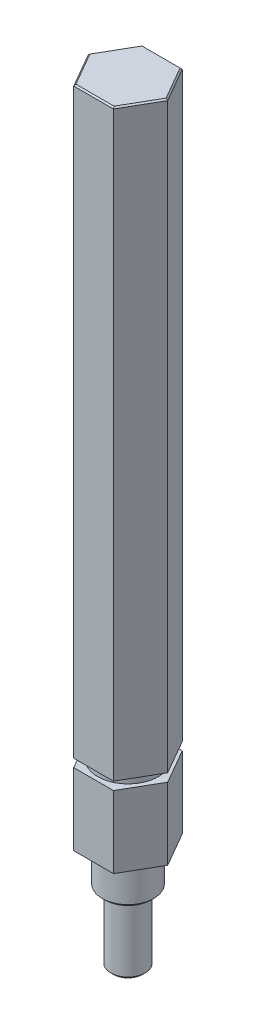
ISO-10303-21;
HEADER;
FILE_DESCRIPTION(('STEP AP214'),'2;1');
FILE_NAME('part.step','',(''),(''),'','','');
FILE_SCHEMA(('AUTOMOTIVE_DESIGN { 1 0 10303 214 1 1 1 1 }'));
ENDSEC;
DATA;
#1=APPLICATION_CONTEXT('core data for automotive mechanical design processes');
#2=APPLICATION_PROTOCOL_DEFINITION('international standard','automotive_design',2000,#1);
#3=PRODUCT_CONTEXT('',#1,'mechanical');
#4=PRODUCT('Part','Part','',(#3));
#5=PRODUCT_RELATED_PRODUCT_CATEGORY('part','',(#4));
#6=PRODUCT_DEFINITION_FORMATION('','',#4);
#7=PRODUCT_DEFINITION_CONTEXT('part definition',#1,'design');
#8=PRODUCT_DEFINITION('design','',#6,#7);
#9=PRODUCT_DEFINITION_SHAPE('','',#8);
#10=(LENGTH_UNIT() NAMED_UNIT(*) SI_UNIT(.MILLI.,.METRE.));
#11=(NAMED_UNIT(*) PLANE_ANGLE_UNIT() SI_UNIT($,.RADIAN.));
#12=(NAMED_UNIT(*) SI_UNIT($,.STERADIAN.) SOLID_ANGLE_UNIT());
#13=UNCERTAINTY_MEASURE_WITH_UNIT(LENGTH_MEASURE(1.E-05),#10,'distance_accuracy_value','');
#14=(GEOMETRIC_REPRESENTATION_CONTEXT(3) GLOBAL_UNCERTAINTY_ASSIGNED_CONTEXT((#13)) GLOBAL_UNIT_ASSIGNED_CONTEXT((#10,
#11,#12)) REPRESENTATION_CONTEXT('',''));
#15=CARTESIAN_POINT('',(0.,0.,0.));
#16=DIRECTION('',(0.,0.,1.));
#17=DIRECTION('',(1.,0.,0.));
#18=AXIS2_PLACEMENT_3D('',#15,#16,#17);
#19=CARTESIAN_POINT('',(-45.6394821348514,-25.4,-16.669011646302));
#20=DIRECTION('',(-0.866025403784438,0.,0.5));
#21=DIRECTION('',(0.5,0.,0.866025403784439));
#22=AXIS2_PLACEMENT_3D('',#19,#20,#21);
#23=PLANE('',#22);
#24=DIRECTION('',(0.5,0.,0.866025403784439));
#25=VECTOR('',#24,1.);
#26=CARTESIAN_POINT('',(-45.6394821348514,-12.1158,-16.669011646302));
#27=LINE('',#26,#25);
#28=CARTESIAN_POINT('',(-45.6394821348514,-12.1158,-16.669011646302));
#29=VERTEX_POINT('',#28);
#30=CARTESIAN_POINT('',(-41.9733079254973,-12.1158,-10.319011646302));
#31=VERTEX_POINT('',#30);
#32=EDGE_CURVE('E264',#29,#31,#27,.T.);
#33=ORIENTED_EDGE('',*,*,#32,.F.);
#34=DIRECTION('',(0.,1.,0.));
#35=VECTOR('',#34,1.);
#36=CARTESIAN_POINT('',(-45.6394821348514,-25.4,-16.669011646302));
#37=LINE('',#36,#35);
#38=CARTESIAN_POINT('',(-45.6394821348514,-25.4,-16.669011646302));
#39=VERTEX_POINT('',#38);
#40=EDGE_CURVE('E300',#39,#29,#37,.T.);
#41=ORIENTED_EDGE('',*,*,#40,.F.);
#42=DIRECTION('',(0.5,0.,0.866025403784439));
#43=VECTOR('',#42,1.);
#44=CARTESIAN_POINT('',(-45.6394821348514,-25.4,-16.669011646302));
#45=LINE('',#44,#43);
#46=CARTESIAN_POINT('',(-41.9733079254973,-25.4,-10.319011646302));
#47=VERTEX_POINT('',#46);
#48=EDGE_CURVE('E284',#39,#47,#45,.T.);
#49=ORIENTED_EDGE('',*,*,#48,.T.);
#50=DIRECTION('',(0.,1.,0.));
#51=VECTOR('',#50,1.);
#52=CARTESIAN_POINT('',(-41.9733079254973,-25.4,-10.319011646302));
#53=LINE('',#52,#51);
#54=EDGE_CURVE('E193',#47,#31,#53,.T.);
#55=ORIENTED_EDGE('',*,*,#54,.T.);
#56=EDGE_LOOP('',(#33,#41,#49,#55));
#57=FACE_BOUND('',#56,.T.);
#58=ADVANCED_FACE('F50',(#57),#23,.T.);
#59=CARTESIAN_POINT('',(-41.9733079254973,-25.4,-10.319011646302));
#60=DIRECTION('',(0.,0.,1.));
#61=DIRECTION('',(1.,0.,0.));
#62=AXIS2_PLACEMENT_3D('',#59,#60,#61);
#63=PLANE('',#62);
#64=DIRECTION('',(1.,0.,0.));
#65=VECTOR('',#64,1.);
#66=CARTESIAN_POINT('',(-41.9733079254973,-12.1158,-10.319011646302));
#67=LINE('',#66,#65);
#68=CARTESIAN_POINT('',(-34.640959506789,-12.1158,-10.319011646302));
#69=VERTEX_POINT('',#68);
#70=EDGE_CURVE('E165',#31,#69,#67,.T.);
#71=ORIENTED_EDGE('',*,*,#70,.F.);
#72=ORIENTED_EDGE('',*,*,#54,.F.);
#73=DIRECTION('',(1.,0.,0.));
#74=VECTOR('',#73,1.);
#75=CARTESIAN_POINT('',(-41.9733079254973,-25.4,-10.319011646302));
#76=LINE('',#75,#74);
#77=CARTESIAN_POINT('',(-34.640959506789,-25.4,-10.319011646302));
#78=VERTEX_POINT('',#77);
#79=EDGE_CURVE('E285',#47,#78,#76,.T.);
#80=ORIENTED_EDGE('',*,*,#79,.T.);
#81=DIRECTION('',(0.,1.,0.));
#82=VECTOR('',#81,1.);
#83=CARTESIAN_POINT('',(-34.640959506789,-25.4,-10.319011646302));
#84=LINE('',#83,#82);
#85=EDGE_CURVE('E187',#78,#69,#84,.T.);
#86=ORIENTED_EDGE('',*,*,#85,.T.);
#87=EDGE_LOOP('',(#71,#72,#80,#86));
#88=FACE_BOUND('',#87,.T.);
#89=ADVANCED_FACE('F358',(#88),#63,.T.);
#90=CARTESIAN_POINT('',(-34.640959506789,-25.4,-10.319011646302));
#91=DIRECTION('',(0.866025403784438,0.,0.500000000000001));
#92=DIRECTION('',(0.500000000000001,0.,-0.866025403784438));
#93=AXIS2_PLACEMENT_3D('',#90,#91,#92);
#94=PLANE('',#93);
#95=DIRECTION('',(0.500000000000001,0.,-0.866025403784438));
#96=VECTOR('',#95,1.);
#97=CARTESIAN_POINT('',(-34.640959506789,-12.1158,-10.319011646302));
#98=LINE('',#97,#96);
#99=CARTESIAN_POINT('',(-30.9747852974349,-12.1158,-16.669011646302));
#100=VERTEX_POINT('',#99);
#101=EDGE_CURVE('E159',#69,#100,#98,.T.);
#102=ORIENTED_EDGE('',*,*,#101,.F.);
#103=ORIENTED_EDGE('',*,*,#85,.F.);
#104=DIRECTION('',(0.500000000000001,0.,-0.866025403784438));
#105=VECTOR('',#104,1.);
#106=CARTESIAN_POINT('',(-34.640959506789,-25.4,-10.319011646302));
#107=LINE('',#106,#105);
#108=CARTESIAN_POINT('',(-30.9747852974349,-25.4,-16.669011646302));
#109=VERTEX_POINT('',#108);
#110=EDGE_CURVE('E181',#78,#109,#107,.T.);
#111=ORIENTED_EDGE('',*,*,#110,.T.);
#112=DIRECTION('',(0.,1.,0.));
#113=VECTOR('',#112,1.);
#114=CARTESIAN_POINT('',(-30.9747852974349,-25.4,-16.669011646302));
#115=LINE('',#114,#113);
#116=EDGE_CURVE('E174',#109,#100,#115,.T.);
#117=ORIENTED_EDGE('',*,*,#116,.T.);
#118=EDGE_LOOP('',(#102,#103,#111,#117));
#119=FACE_BOUND('',#118,.T.);
#120=ADVANCED_FACE('F179',(#119),#94,.T.);
#121=CARTESIAN_POINT('',(-30.9747852974349,-25.4,-16.669011646302));
#122=DIRECTION('',(0.866025403784438,0.,-0.5));
#123=DIRECTION('',(-0.5,0.,-0.866025403784439));
#124=AXIS2_PLACEMENT_3D('',#121,#122,#123);
#125=PLANE('',#124);
#126=DIRECTION('',(-0.5,0.,-0.866025403784439));
#127=VECTOR('',#126,1.);
#128=CARTESIAN_POINT('',(-30.9747852974349,-12.1158,-16.669011646302));
#129=LINE('',#128,#127);
#130=CARTESIAN_POINT('',(-34.640959506789,-12.1158,-23.019011646302));
#131=VERTEX_POINT('',#130);
#132=EDGE_CURVE('E162',#100,#131,#129,.T.);
#133=ORIENTED_EDGE('',*,*,#132,.F.);
#134=ORIENTED_EDGE('',*,*,#116,.F.);
#135=DIRECTION('',(-0.5,0.,-0.866025403784439));
#136=VECTOR('',#135,1.);
#137=CARTESIAN_POINT('',(-30.9747852974349,-25.4,-16.669011646302));
#138=LINE('',#137,#136);
#139=CARTESIAN_POINT('',(-34.640959506789,-25.4,-23.019011646302));
#140=VERTEX_POINT('',#139);
#141=EDGE_CURVE('E289',#109,#140,#138,.T.);
#142=ORIENTED_EDGE('',*,*,#141,.T.);
#143=DIRECTION('',(0.,1.,0.));
#144=VECTOR('',#143,1.);
#145=CARTESIAN_POINT('',(-34.640959506789,-25.4,-23.019011646302));
#146=LINE('',#145,#144);
#147=EDGE_CURVE('E176',#140,#131,#146,.T.);
#148=ORIENTED_EDGE('',*,*,#147,.T.);
#149=EDGE_LOOP('',(#133,#134,#142,#148));
#150=FACE_BOUND('',#149,.T.);
#151=ADVANCED_FACE('F172',(#150),#125,.T.);
#152=CARTESIAN_POINT('',(-34.640959506789,-25.4,-23.019011646302));
#153=DIRECTION('',(0.,0.,-1.));
#154=DIRECTION('',(-1.,0.,0.));
#155=AXIS2_PLACEMENT_3D('',#152,#153,#154);
#156=PLANE('',#155);
#157=DIRECTION('',(-1.,0.,0.));
#158=VECTOR('',#157,1.);
#159=CARTESIAN_POINT('',(-34.640959506789,-12.1158,-23.019011646302));
#160=LINE('',#159,#158);
#161=CARTESIAN_POINT('',(-41.9733079254973,-12.1158,-23.019011646302));
#162=VERTEX_POINT('',#161);
#163=EDGE_CURVE('E177',#131,#162,#160,.T.);
#164=ORIENTED_EDGE('',*,*,#163,.F.);
#165=ORIENTED_EDGE('',*,*,#147,.F.);
#166=DIRECTION('',(-1.,0.,0.));
#167=VECTOR('',#166,1.);
#168=CARTESIAN_POINT('',(-34.640959506789,-25.4,-23.019011646302));
#169=LINE('',#168,#167);
#170=CARTESIAN_POINT('',(-41.9733079254973,-25.4,-23.019011646302));
#171=VERTEX_POINT('',#170);
#172=EDGE_CURVE('E291',#140,#171,#169,.T.);
#173=ORIENTED_EDGE('',*,*,#172,.T.);
#174=DIRECTION('',(0.,1.,0.));
#175=VECTOR('',#174,1.);
#176=CARTESIAN_POINT('',(-41.9733079254973,-25.4,-23.019011646302));
#177=LINE('',#176,#175);
#178=EDGE_CURVE('E303',#171,#162,#177,.T.);
#179=ORIENTED_EDGE('',*,*,#178,.T.);
#180=EDGE_LOOP('',(#164,#165,#173,#179));
#181=FACE_BOUND('',#180,.T.);
#182=ADVANCED_FACE('F463',(#181),#156,.T.);
#183=CARTESIAN_POINT('',(-41.9733079254973,-25.4,-23.019011646302));
#184=DIRECTION('',(-0.866025403784438,0.,-0.5));
#185=DIRECTION('',(-0.5,0.,0.866025403784439));
#186=AXIS2_PLACEMENT_3D('',#183,#184,#185);
#187=PLANE('',#186);
#188=DIRECTION('',(-0.5,0.,0.866025403784439));
#189=VECTOR('',#188,1.);
#190=CARTESIAN_POINT('',(-41.9733079254973,-12.1158,-23.019011646302));
#191=LINE('',#190,#189);
#192=EDGE_CURVE('E208',#162,#29,#191,.T.);
#193=ORIENTED_EDGE('',*,*,#192,.F.);
#194=ORIENTED_EDGE('',*,*,#178,.F.);
#195=DIRECTION('',(-0.5,0.,0.866025403784439));
#196=VECTOR('',#195,1.);
#197=CARTESIAN_POINT('',(-41.9733079254973,-25.4,-23.019011646302));
#198=LINE('',#197,#196);
#199=EDGE_CURVE('E294',#171,#39,#198,.T.);
#200=ORIENTED_EDGE('',*,*,#199,.T.);
#201=ORIENTED_EDGE('',*,*,#40,.T.);
#202=EDGE_LOOP('',(#193,#194,#200,#201));
#203=FACE_BOUND('',#202,.T.);
#204=ADVANCED_FACE('F473',(#203),#187,.T.);
#205=CARTESIAN_POINT('',(-38.3071337161431,-25.4,-3.96901164630201));
#206=DIRECTION('',(0.,1.,0.));
#207=DIRECTION('',(0.,0.,1.));
#208=AXIS2_PLACEMENT_3D('',#205,#206,#207);
#209=PLANE('',#208);
#210=CARTESIAN_POINT('',(-38.3071337161431,-25.4,-16.669011646302));
#211=DIRECTION('',(0.,1.,0.));
#212=DIRECTION('',(1.,0.,0.));
#213=AXIS2_PLACEMENT_3D('',#210,#211,#212);
#214=CIRCLE('',#213,4.7498);
#215=CARTESIAN_POINT('',(-33.5573337161431,-25.4,-16.669011646302));
#216=VERTEX_POINT('',#215);
#217=EDGE_CURVE('E280',#216,#216,#214,.T.);
#218=ORIENTED_EDGE('',*,*,#217,.T.);
#219=EDGE_LOOP('',(#218));
#220=FACE_BOUND('',#219,.T.);
#221=ORIENTED_EDGE('',*,*,#48,.F.);
#222=ORIENTED_EDGE('',*,*,#199,.F.);
#223=ORIENTED_EDGE('',*,*,#172,.F.);
#224=ORIENTED_EDGE('',*,*,#141,.F.);
#225=ORIENTED_EDGE('',*,*,#110,.F.);
#226=ORIENTED_EDGE('',*,*,#79,.F.);
#227=EDGE_LOOP('',(#221,#222,#223,#224,#225,#226));
#228=FACE_BOUND('',#227,.T.);
#229=ADVANCED_FACE('F579',(#220,#228),#209,.F.);
#230=CARTESIAN_POINT('',(-38.3071337161431,-32.512,-16.669011646302));
#231=DIRECTION('',(0.,1.,0.));
#232=DIRECTION('',(0.,0.,1.));
#233=AXIS2_PLACEMENT_3D('',#230,#231,#232);
#234=CYLINDRICAL_SURFACE('',#233,4.7498);
#235=CARTESIAN_POINT('',(-38.3071337161431,-32.004,-16.669011646302));
#236=DIRECTION('',(0.,1.,0.));
#237=DIRECTION('',(0.,0.,1.));
#238=AXIS2_PLACEMENT_3D('',#235,#236,#237);
#239=CIRCLE('',#238,4.7498);
#240=CARTESIAN_POINT('',(-38.3071337161431,-32.004,-11.919211646302));
#241=VERTEX_POINT('',#240);
#242=EDGE_CURVE('E196',#241,#241,#239,.T.);
#243=ORIENTED_EDGE('',*,*,#242,.T.);
#244=EDGE_LOOP('',(#243));
#245=FACE_BOUND('',#244,.T.);
#246=ORIENTED_EDGE('',*,*,#217,.F.);
#247=EDGE_LOOP('',(#246));
#248=FACE_BOUND('',#247,.T.);
#249=ADVANCED_FACE('F568',(#245,#248),#234,.T.);
#250=CARTESIAN_POINT('',(-38.3071337161431,-32.512,-16.669011646302));
#251=DIRECTION('',(0.,1.,0.));
#252=DIRECTION('',(0.,0.,1.));
#253=AXIS2_PLACEMENT_3D('',#250,#251,#252);
#254=PLANE('',#253);
#255=CARTESIAN_POINT('',(-38.3071337161431,-32.512,-16.669011646302));
#256=DIRECTION('',(0.,1.,0.));
#257=DIRECTION('',(0.,0.,1.));
#258=AXIS2_PLACEMENT_3D('',#255,#256,#257);
#259=CIRCLE('',#258,3.1623);
#260=CARTESIAN_POINT('',(-38.3071337161431,-32.512,-13.506711646302));
#261=VERTEX_POINT('',#260);
#262=EDGE_CURVE('E276',#261,#261,#259,.T.);
#263=ORIENTED_EDGE('',*,*,#262,.T.);
#264=EDGE_LOOP('',(#263));
#265=FACE_BOUND('',#264,.T.);
#266=CARTESIAN_POINT('',(-38.3071337161431,-32.512,-16.669011646302));
#267=DIRECTION('',(0.,1.,0.));
#268=DIRECTION('',(0.,0.,1.));
#269=AXIS2_PLACEMENT_3D('',#266,#267,#268);
#270=CIRCLE('',#269,4.2418);
#271=CARTESIAN_POINT('',(-38.3071337161431,-32.512,-12.427211646302));
#272=VERTEX_POINT('',#271);
#273=EDGE_CURVE('E199',#272,#272,#270,.F.);
#274=ORIENTED_EDGE('',*,*,#273,.T.);
#275=EDGE_LOOP('',(#274));
#276=FACE_BOUND('',#275,.T.);
#277=ADVANCED_FACE('F556',(#265,#276),#254,.F.);
#278=CARTESIAN_POINT('',(-38.3071337161431,-32.004,-16.669011646302));
#279=DIRECTION('',(0.,1.,0.));
#280=DIRECTION('',(0.,0.,1.));
#281=AXIS2_PLACEMENT_3D('',#278,#279,#280);
#282=CONICAL_SURFACE('',#281,4.7498,0.785398163397443);
#283=ORIENTED_EDGE('',*,*,#273,.F.);
#284=EDGE_LOOP('',(#283));
#285=FACE_BOUND('',#284,.T.);
#286=ORIENTED_EDGE('',*,*,#242,.F.);
#287=EDGE_LOOP('',(#286));
#288=FACE_BOUND('',#287,.T.);
#289=ADVANCED_FACE('F543',(#285,#288),#282,.T.);
#290=CARTESIAN_POINT('',(-38.3071337161431,-45.212,-16.669011646302));
#291=DIRECTION('',(0.,1.,0.));
#292=DIRECTION('',(0.,0.,1.));
#293=AXIS2_PLACEMENT_3D('',#290,#291,#292);
#294=CYLINDRICAL_SURFACE('',#293,3.1623);
#295=CARTESIAN_POINT('',(-38.3071337161431,-44.704,-16.669011646302));
#296=DIRECTION('',(0.,1.,0.));
#297=DIRECTION('',(0.,0.,1.));
#298=AXIS2_PLACEMENT_3D('',#295,#296,#297);
#299=CIRCLE('',#298,3.1623);
#300=CARTESIAN_POINT('',(-38.3071337161431,-44.704,-13.506711646302));
#301=VERTEX_POINT('',#300);
#302=EDGE_CURVE('E202',#301,#301,#299,.T.);
#303=ORIENTED_EDGE('',*,*,#302,.T.);
#304=EDGE_LOOP('',(#303));
#305=FACE_BOUND('',#304,.T.);
#306=ORIENTED_EDGE('',*,*,#262,.F.);
#307=EDGE_LOOP('',(#306));
#308=FACE_BOUND('',#307,.T.);
#309=ADVANCED_FACE('F531',(#305,#308),#294,.T.);
#310=CARTESIAN_POINT('',(-38.3071337161431,-45.212,-16.669011646302));
#311=DIRECTION('',(0.,1.,0.));
#312=DIRECTION('',(0.,0.,1.));
#313=AXIS2_PLACEMENT_3D('',#310,#311,#312);
#314=PLANE('',#313);
#315=CARTESIAN_POINT('',(-38.3071337161431,-45.212,-16.669011646302));
#316=DIRECTION('',(0.,1.,0.));
#317=DIRECTION('',(0.,0.,1.));
#318=AXIS2_PLACEMENT_3D('',#315,#316,#317);
#319=CIRCLE('',#318,2.6543);
#320=CARTESIAN_POINT('',(-38.3071337161431,-45.212,-14.014711646302));
#321=VERTEX_POINT('',#320);
#322=EDGE_CURVE('E205',#321,#321,#319,.F.);
#323=ORIENTED_EDGE('',*,*,#322,.T.);
#324=EDGE_LOOP('',(#323));
#325=FACE_BOUND('',#324,.T.);
#326=ADVANCED_FACE('F485',(#325),#314,.F.);
#327=CARTESIAN_POINT('',(-38.3071337161431,-44.704,-16.669011646302));
#328=DIRECTION('',(0.,1.,0.));
#329=DIRECTION('',(0.,0.,1.));
#330=AXIS2_PLACEMENT_3D('',#327,#328,#329);
#331=CONICAL_SURFACE('',#330,3.1623,0.785398163397445);
#332=ORIENTED_EDGE('',*,*,#322,.F.);
#333=EDGE_LOOP('',(#332));
#334=FACE_BOUND('',#333,.T.);
#335=ORIENTED_EDGE('',*,*,#302,.F.);
#336=EDGE_LOOP('',(#335));
#337=FACE_BOUND('',#336,.T.);
#338=ADVANCED_FACE('F479',(#334,#337),#331,.T.);
#339=CARTESIAN_POINT('',(-38.3071337161431,-25.4,-16.669011646302));
#340=DIRECTION('',(0.,1.,0.));
#341=DIRECTION('',(0.,0.,1.));
#342=AXIS2_PLACEMENT_3D('',#339,#340,#341);
#343=CYLINDRICAL_SURFACE('',#342,5.58800000000003);
#344=CARTESIAN_POINT('',(-38.3071337161431,-10.6172,-16.669011646302));
#345=DIRECTION('',(0.,1.,0.));
#346=DIRECTION('',(0.,0.,1.));
#347=AXIS2_PLACEMENT_3D('',#344,#345,#346);
#348=CIRCLE('',#347,5.58800000000003);
#349=CARTESIAN_POINT('',(-38.3071337161431,-10.6172,-11.081011646302));
#350=VERTEX_POINT('',#349);
#351=EDGE_CURVE('E255',#350,#350,#348,.T.);
#352=ORIENTED_EDGE('',*,*,#351,.F.);
#353=EDGE_LOOP('',(#352));
#354=FACE_BOUND('',#353,.T.);
#355=CARTESIAN_POINT('',(-38.3071337161431,-12.1158,-16.669011646302));
#356=DIRECTION('',(0.,1.,0.));
#357=DIRECTION('',(0.,0.,1.));
#358=AXIS2_PLACEMENT_3D('',#355,#356,#357);
#359=CIRCLE('',#358,5.58800000000003);
#360=CARTESIAN_POINT('',(-38.3071337161431,-12.1158,-11.081011646302));
#361=VERTEX_POINT('',#360);
#362=EDGE_CURVE('E249',#361,#361,#359,.T.);
#363=ORIENTED_EDGE('',*,*,#362,.T.);
#364=EDGE_LOOP('',(#363));
#365=FACE_BOUND('',#364,.T.);
#366=ADVANCED_FACE('F484',(#354,#365),#343,.T.);
#367=CARTESIAN_POINT('',(-32.7191337161431,-10.6172,-16.669011646302));
#368=DIRECTION('',(0.,1.,0.));
#369=DIRECTION('',(0.,0.,1.));
#370=AXIS2_PLACEMENT_3D('',#367,#368,#369);
#371=PLANE('',#370);
#372=DIRECTION('',(0.5,0.,0.866025403784439));
#373=VECTOR('',#372,1.);
#374=CARTESIAN_POINT('',(-30.9747852974349,-10.6172,-16.669011646302));
#375=LINE('',#374,#373);
#376=CARTESIAN_POINT('',(-34.640959506789,-10.6172,-23.019011646302));
#377=VERTEX_POINT('',#376);
#378=CARTESIAN_POINT('',(-30.9747852974349,-10.6172,-16.669011646302));
#379=VERTEX_POINT('',#378);
#380=EDGE_CURVE('E268',#377,#379,#375,.T.);
#381=ORIENTED_EDGE('',*,*,#380,.T.);
#382=DIRECTION('',(-0.500000000000001,0.,0.866025403784438));
#383=VECTOR('',#382,1.);
#384=CARTESIAN_POINT('',(-34.640959506789,-10.6172,-10.319011646302));
#385=LINE('',#384,#383);
#386=CARTESIAN_POINT('',(-34.640959506789,-10.6172,-10.319011646302));
#387=VERTEX_POINT('',#386);
#388=EDGE_CURVE('E270',#379,#387,#385,.T.);
#389=ORIENTED_EDGE('',*,*,#388,.T.);
#390=DIRECTION('',(-1.,0.,0.));
#391=VECTOR('',#390,1.);
#392=CARTESIAN_POINT('',(-41.9733079254973,-10.6172,-10.319011646302));
#393=LINE('',#392,#391);
#394=CARTESIAN_POINT('',(-41.9733079254973,-10.6172,-10.319011646302));
#395=VERTEX_POINT('',#394);
#396=EDGE_CURVE('E272',#387,#395,#393,.T.);
#397=ORIENTED_EDGE('',*,*,#396,.T.);
#398=DIRECTION('',(-0.5,0.,-0.866025403784439));
#399=VECTOR('',#398,1.);
#400=CARTESIAN_POINT('',(-45.6394821348514,-10.6172,-16.669011646302));
#401=LINE('',#400,#399);
#402=CARTESIAN_POINT('',(-45.6394821348514,-10.6172,-16.669011646302));
#403=VERTEX_POINT('',#402);
#404=EDGE_CURVE('E274',#395,#403,#401,.T.);
#405=ORIENTED_EDGE('',*,*,#404,.T.);
#406=DIRECTION('',(0.5,0.,-0.866025403784439));
#407=VECTOR('',#406,1.);
#408=CARTESIAN_POINT('',(-41.9733079254973,-10.6172,-23.019011646302));
#409=LINE('',#408,#407);
#410=CARTESIAN_POINT('',(-41.9733079254973,-10.6172,-23.019011646302));
#411=VERTEX_POINT('',#410);
#412=EDGE_CURVE('E210',#403,#411,#409,.T.);
#413=ORIENTED_EDGE('',*,*,#412,.T.);
#414=DIRECTION('',(1.,0.,0.));
#415=VECTOR('',#414,1.);
#416=CARTESIAN_POINT('',(-34.640959506789,-10.6172,-23.019011646302));
#417=LINE('',#416,#415);
#418=EDGE_CURVE('E266',#411,#377,#417,.T.);
#419=ORIENTED_EDGE('',*,*,#418,.T.);
#420=EDGE_LOOP('',(#381,#389,#397,#405,#413,#419));
#421=FACE_BOUND('',#420,.T.);
#422=ORIENTED_EDGE('',*,*,#351,.T.);
#423=EDGE_LOOP('',(#422));
#424=FACE_BOUND('',#423,.T.);
#425=ADVANCED_FACE('F499',(#421,#424),#371,.F.);
#426=CARTESIAN_POINT('',(-21.7881364409388,-12.1158,-16.669011646302));
#427=DIRECTION('',(0.,-1.,0.));
#428=DIRECTION('',(0.,0.,-1.));
#429=AXIS2_PLACEMENT_3D('',#426,#427,#428);
#430=PLANE('',#429);
#431=ORIENTED_EDGE('',*,*,#362,.F.);
#432=EDGE_LOOP('',(#431));
#433=FACE_BOUND('',#432,.T.);
#434=ORIENTED_EDGE('',*,*,#32,.T.);
#435=ORIENTED_EDGE('',*,*,#70,.T.);
#436=ORIENTED_EDGE('',*,*,#101,.T.);
#437=ORIENTED_EDGE('',*,*,#132,.T.);
#438=ORIENTED_EDGE('',*,*,#163,.T.);
#439=ORIENTED_EDGE('',*,*,#192,.T.);
#440=EDGE_LOOP('',(#434,#435,#436,#437,#438,#439));
#441=FACE_BOUND('',#440,.T.);
#442=ADVANCED_FACE('F161',(#433,#441),#430,.F.);
#443=CARTESIAN_POINT('',(-45.6394821348514,96.8273400000005,-16.669011646302));
#444=VERTEX_POINT('',#443);
#445=EDGE_CURVE('E297',#403,#444,#37,.T.);
#446=ORIENTED_EDGE('',*,*,#445,.T.);
#447=DIRECTION('',(0.5,0.,-0.866025403784439));
#448=VECTOR('',#447,1.);
#449=CARTESIAN_POINT('',(-41.9733079254972,96.8273400000005,-23.0190116463021));
#450=LINE('',#449,#448);
#451=CARTESIAN_POINT('',(-41.9733079254973,96.8273400000005,-23.019011646302));
#452=VERTEX_POINT('',#451);
#453=EDGE_CURVE('E230',#444,#452,#450,.T.);
#454=ORIENTED_EDGE('',*,*,#453,.T.);
#455=EDGE_CURVE('E302',#411,#452,#177,.T.);
#456=ORIENTED_EDGE('',*,*,#455,.F.);
#457=ORIENTED_EDGE('',*,*,#412,.F.);
#458=EDGE_LOOP('',(#446,#454,#456,#457));
#459=FACE_BOUND('',#458,.T.);
#460=ADVANCED_FACE('F345',(#459),#187,.T.);
#461=ORIENTED_EDGE('',*,*,#455,.T.);
#462=DIRECTION('',(1.,0.,0.));
#463=VECTOR('',#462,1.);
#464=CARTESIAN_POINT('',(-34.6409595067889,96.8273400000005,-23.019011646302));
#465=LINE('',#464,#463);
#466=CARTESIAN_POINT('',(-34.640959506789,96.8273400000005,-23.019011646302));
#467=VERTEX_POINT('',#466);
#468=EDGE_CURVE('E74',#452,#467,#465,.T.);
#469=ORIENTED_EDGE('',*,*,#468,.T.);
#470=EDGE_CURVE('E305',#377,#467,#146,.T.);
#471=ORIENTED_EDGE('',*,*,#470,.F.);
#472=ORIENTED_EDGE('',*,*,#418,.F.);
#473=EDGE_LOOP('',(#461,#469,#471,#472));
#474=FACE_BOUND('',#473,.T.);
#475=ADVANCED_FACE('F309',(#474),#156,.T.);
#476=ORIENTED_EDGE('',*,*,#470,.T.);
#477=DIRECTION('',(0.5,0.,0.866025403784439));
#478=VECTOR('',#477,1.);
#479=CARTESIAN_POINT('',(-30.9747852974349,96.8273400000005,-16.669011646302));
#480=LINE('',#479,#478);
#481=CARTESIAN_POINT('',(-30.9747852974349,96.8273400000005,-16.669011646302));
#482=VERTEX_POINT('',#481);
#483=EDGE_CURVE('E59',#467,#482,#480,.T.);
#484=ORIENTED_EDGE('',*,*,#483,.T.);
#485=EDGE_CURVE('E184',#379,#482,#115,.T.);
#486=ORIENTED_EDGE('',*,*,#485,.F.);
#487=ORIENTED_EDGE('',*,*,#380,.F.);
#488=EDGE_LOOP('',(#476,#484,#486,#487));
#489=FACE_BOUND('',#488,.T.);
#490=ADVANCED_FACE('F444',(#489),#125,.T.);
#491=ORIENTED_EDGE('',*,*,#485,.T.);
#492=DIRECTION('',(-0.500000000000001,0.,0.866025403784438));
#493=VECTOR('',#492,1.);
#494=CARTESIAN_POINT('',(-34.640959506789,96.8273400000005,-10.3190116463021));
#495=LINE('',#494,#493);
#496=CARTESIAN_POINT('',(-34.640959506789,96.8273400000005,-10.319011646302));
#497=VERTEX_POINT('',#496);
#498=EDGE_CURVE('E11',#482,#497,#495,.T.);
#499=ORIENTED_EDGE('',*,*,#498,.T.);
#500=EDGE_CURVE('E183',#387,#497,#84,.T.);
#501=ORIENTED_EDGE('',*,*,#500,.F.);
#502=ORIENTED_EDGE('',*,*,#388,.F.);
#503=EDGE_LOOP('',(#491,#499,#501,#502));
#504=FACE_BOUND('',#503,.T.);
#505=ADVANCED_FACE('F323',(#504),#94,.T.);
#506=ORIENTED_EDGE('',*,*,#500,.T.);
#507=DIRECTION('',(-1.,0.,0.));
#508=VECTOR('',#507,1.);
#509=CARTESIAN_POINT('',(-41.9733079254972,96.8273400000005,-10.319011646302));
#510=LINE('',#509,#508);
#511=CARTESIAN_POINT('',(-41.9733079254973,96.8273400000005,-10.319011646302));
#512=VERTEX_POINT('',#511);
#513=EDGE_CURVE('E225',#497,#512,#510,.T.);
#514=ORIENTED_EDGE('',*,*,#513,.T.);
#515=EDGE_CURVE('E192',#395,#512,#53,.T.);
#516=ORIENTED_EDGE('',*,*,#515,.F.);
#517=ORIENTED_EDGE('',*,*,#396,.F.);
#518=EDGE_LOOP('',(#506,#514,#516,#517));
#519=FACE_BOUND('',#518,.T.);
#520=ADVANCED_FACE('F328',(#519),#63,.T.);
#521=ORIENTED_EDGE('',*,*,#515,.T.);
#522=DIRECTION('',(-0.5,0.,-0.866025403784439));
#523=VECTOR('',#522,1.);
#524=CARTESIAN_POINT('',(-45.6394821348514,96.8273400000005,-16.669011646302));
#525=LINE('',#524,#523);
#526=EDGE_CURVE('E228',#512,#444,#525,.T.);
#527=ORIENTED_EDGE('',*,*,#526,.T.);
#528=ORIENTED_EDGE('',*,*,#445,.F.);
#529=ORIENTED_EDGE('',*,*,#404,.F.);
#530=EDGE_LOOP('',(#521,#527,#528,#529));
#531=FACE_BOUND('',#530,.T.);
#532=ADVANCED_FACE('F343',(#531),#23,.T.);
#533=CARTESIAN_POINT('',(-38.3071337161451,97.0813400000005,-16.6690116463026));
#534=DIRECTION('',(0.,1.,0.));
#535=DIRECTION('',(-0.500000000000001,0.,0.866025403784438));
#536=AXIS2_PLACEMENT_3D('',#533,#534,#535);
#537=PLANE('',#536);
#538=DIRECTION('',(0.5,0.,0.866025403784439));
#539=VECTOR('',#538,1.);
#540=CARTESIAN_POINT('',(-43.5864245776138,97.0813400000005,-13.6210116463033));
#541=LINE('',#540,#539);
#542=CARTESIAN_POINT('',(-45.3461881981031,97.0813400000005,-16.669011646302));
#543=VERTEX_POINT('',#542);
#544=CARTESIAN_POINT('',(-41.8266609571231,97.0813400000005,-10.573011646302));
#545=VERTEX_POINT('',#544);
#546=EDGE_CURVE('E220',#543,#545,#541,.T.);
#547=ORIENTED_EDGE('',*,*,#546,.T.);
#548=DIRECTION('',(1.,0.,0.));
#549=VECTOR('',#548,1.);
#550=CARTESIAN_POINT('',(-38.3071337161451,97.0813400000005,-10.573011646302));
#551=LINE('',#550,#549);
#552=CARTESIAN_POINT('',(-34.7876064751632,97.0813400000005,-10.573011646302));
#553=VERTEX_POINT('',#552);
#554=EDGE_CURVE('E222',#545,#553,#551,.T.);
#555=ORIENTED_EDGE('',*,*,#554,.T.);
#556=DIRECTION('',(0.500000000000001,0.,-0.866025403784438));
#557=VECTOR('',#556,1.);
#558=CARTESIAN_POINT('',(-33.0278428546734,97.0813400000005,-13.6210116463016));
#559=LINE('',#558,#557);
#560=CARTESIAN_POINT('',(-31.2680792341832,97.0813400000005,-16.669011646302));
#561=VERTEX_POINT('',#560);
#562=EDGE_CURVE('E212',#553,#561,#559,.T.);
#563=ORIENTED_EDGE('',*,*,#562,.T.);
#564=DIRECTION('',(-0.5,0.,-0.866025403784439));
#565=VECTOR('',#564,1.);
#566=CARTESIAN_POINT('',(-33.0278428546739,97.0813400000005,-19.7170116463033));
#567=LINE('',#566,#565);
#568=CARTESIAN_POINT('',(-34.7876064751632,97.0813400000005,-22.765011646302));
#569=VERTEX_POINT('',#568);
#570=EDGE_CURVE('E214',#561,#569,#567,.T.);
#571=ORIENTED_EDGE('',*,*,#570,.T.);
#572=DIRECTION('',(-1.,0.,0.));
#573=VECTOR('',#572,1.);
#574=CARTESIAN_POINT('',(-38.3071337161451,97.0813400000005,-22.765011646302));
#575=LINE('',#574,#573);
#576=CARTESIAN_POINT('',(-41.8266609571231,97.0813400000005,-22.765011646302));
#577=VERTEX_POINT('',#576);
#578=EDGE_CURVE('E216',#569,#577,#575,.T.);
#579=ORIENTED_EDGE('',*,*,#578,.T.);
#580=DIRECTION('',(-0.5,0.,0.866025403784439));
#581=VECTOR('',#580,1.);
#582=CARTESIAN_POINT('',(-43.5864245776133,97.0813400000005,-19.7170116463016));
#583=LINE('',#582,#581);
#584=EDGE_CURVE('E218',#577,#543,#583,.T.);
#585=ORIENTED_EDGE('',*,*,#584,.T.);
#586=EDGE_LOOP('',(#547,#555,#563,#571,#579,#585));
#587=FACE_BOUND('',#586,.T.);
#588=ADVANCED_FACE('F348',(#587),#537,.T.);
#589=CARTESIAN_POINT('',(-38.3071337161451,97.0813400000005,-22.765011646302));
#590=DIRECTION('',(0.,-0.707106781186551,0.707106781186544));
#591=DIRECTION('',(0.,-0.707106781186544,-0.707106781186551));
#592=AXIS2_PLACEMENT_3D('',#589,#590,#591);
#593=PLANE('',#592);
#594=DIRECTION('',(-0.377964473009204,0.654653670707981,0.654653670707987));
#595=VECTOR('',#594,1.);
#596=CARTESIAN_POINT('',(-35.2903960810172,97.9521971428573,-21.8941545034452));
#597=LINE('',#596,#595);
#598=EDGE_CURVE('E243',#467,#569,#597,.T.);
#599=ORIENTED_EDGE('',*,*,#598,.F.);
#600=ORIENTED_EDGE('',*,*,#468,.F.);
#601=DIRECTION('',(0.377964473009226,0.654653670707974,0.654653670707981));
#602=VECTOR('',#601,1.);
#603=CARTESIAN_POINT('',(-41.3238713512691,97.9521971428571,-21.8941545034453));
#604=LINE('',#603,#602);
#605=EDGE_CURVE('E54',#577,#452,#604,.F.);
#606=ORIENTED_EDGE('',*,*,#605,.F.);
#607=ORIENTED_EDGE('',*,*,#578,.F.);
#608=EDGE_LOOP('',(#599,#600,#606,#607));
#609=FACE_BOUND('',#608,.T.);
#610=ADVANCED_FACE('F52',(#609),#593,.F.);
#611=CARTESIAN_POINT('',(-43.5864245776133,97.0813400000005,-19.7170116463016));
#612=DIRECTION('',(0.612372435695792,-0.70710678118655,0.353553390593274));
#613=DIRECTION('',(0.755928946018457,0.654653670707975,0.));
#614=AXIS2_PLACEMENT_3D('',#611,#612,#613);
#615=PLANE('',#614);
#616=ORIENTED_EDGE('',*,*,#605,.T.);
#617=ORIENTED_EDGE('',*,*,#453,.F.);
#618=DIRECTION('',(0.75592894601846,0.654653670707971,0.));
#619=VECTOR('',#618,1.);
#620=CARTESIAN_POINT('',(-44.3406089863946,97.9521971428575,-16.669011646302));
#621=LINE('',#620,#619);
#622=EDGE_CURVE('E241',#543,#444,#621,.F.);
#623=ORIENTED_EDGE('',*,*,#622,.F.);
#624=ORIENTED_EDGE('',*,*,#584,.F.);
#625=EDGE_LOOP('',(#616,#617,#623,#624));
#626=FACE_BOUND('',#625,.T.);
#627=ADVANCED_FACE('F346',(#626),#615,.F.);
#628=CARTESIAN_POINT('',(-33.0278428546739,97.0813400000005,-19.7170116463033));
#629=DIRECTION('',(-0.612372435695803,-0.707106781186538,0.353553390593279));
#630=DIRECTION('',(0.755928946018445,-0.654653670707988,0.));
#631=AXIS2_PLACEMENT_3D('',#628,#629,#630);
#632=PLANE('',#631);
#633=ORIENTED_EDGE('',*,*,#598,.T.);
#634=ORIENTED_EDGE('',*,*,#570,.F.);
#635=DIRECTION('',(-0.755928946018449,0.654653670707983,0.));
#636=VECTOR('',#635,1.);
#637=CARTESIAN_POINT('',(-32.2736584458919,97.9521971428577,-16.669011646302));
#638=LINE('',#637,#636);
#639=EDGE_CURVE('E238',#482,#561,#638,.T.);
#640=ORIENTED_EDGE('',*,*,#639,.F.);
#641=ORIENTED_EDGE('',*,*,#483,.F.);
#642=EDGE_LOOP('',(#633,#634,#640,#641));
#643=FACE_BOUND('',#642,.T.);
#644=ADVANCED_FACE('F315',(#643),#632,.F.);
#645=CARTESIAN_POINT('',(-43.5864245776138,97.0813400000005,-13.6210116463033));
#646=DIRECTION('',(0.612372435695786,-0.707106781186557,-0.353553390593269));
#647=DIRECTION('',(0.755928946018464,0.654653670707967,0.));
#648=AXIS2_PLACEMENT_3D('',#645,#646,#647);
#649=PLANE('',#648);
#650=ORIENTED_EDGE('',*,*,#622,.T.);
#651=ORIENTED_EDGE('',*,*,#526,.F.);
#652=DIRECTION('',(0.37796447300925,0.654653670707974,-0.654653670707967));
#653=VECTOR('',#652,1.);
#654=CARTESIAN_POINT('',(-41.3238713512686,97.9521971428579,-11.4438687891594));
#655=LINE('',#654,#653);
#656=EDGE_CURVE('E236',#545,#512,#655,.F.);
#657=ORIENTED_EDGE('',*,*,#656,.F.);
#658=ORIENTED_EDGE('',*,*,#546,.F.);
#659=EDGE_LOOP('',(#650,#651,#657,#658));
#660=FACE_BOUND('',#659,.T.);
#661=ADVANCED_FACE('F338',(#660),#649,.F.);
#662=CARTESIAN_POINT('',(-33.0278428546734,97.0813400000005,-13.6210116463016));
#663=DIRECTION('',(-0.612372435695796,-0.707106781186546,-0.353553390593275));
#664=DIRECTION('',(0.755928946018453,-0.654653670707979,0.));
#665=AXIS2_PLACEMENT_3D('',#662,#663,#664);
#666=PLANE('',#665);
#667=ORIENTED_EDGE('',*,*,#639,.T.);
#668=ORIENTED_EDGE('',*,*,#562,.F.);
#669=DIRECTION('',(0.377964473009228,-0.65465367070798,0.654653670707973));
#670=VECTOR('',#669,1.);
#671=CARTESIAN_POINT('',(-35.2903960810174,97.9521971428575,-11.443868789159));
#672=LINE('',#671,#670);
#673=EDGE_CURVE('E234',#497,#553,#672,.F.);
#674=ORIENTED_EDGE('',*,*,#673,.F.);
#675=ORIENTED_EDGE('',*,*,#498,.F.);
#676=EDGE_LOOP('',(#667,#668,#674,#675));
#677=FACE_BOUND('',#676,.T.);
#678=ADVANCED_FACE('F320',(#677),#666,.F.);
#679=CARTESIAN_POINT('',(-38.3071337161451,97.0813400000005,-10.573011646302));
#680=DIRECTION('',(0.,-0.707106781186544,-0.707106781186551));
#681=DIRECTION('',(0.,0.707106781186551,-0.707106781186544));
#682=AXIS2_PLACEMENT_3D('',#679,#680,#681);
#683=PLANE('',#682);
#684=ORIENTED_EDGE('',*,*,#656,.T.);
#685=ORIENTED_EDGE('',*,*,#513,.F.);
#686=ORIENTED_EDGE('',*,*,#673,.T.);
#687=ORIENTED_EDGE('',*,*,#554,.F.);
#688=EDGE_LOOP('',(#684,#685,#686,#687));
#689=FACE_BOUND('',#688,.T.);
#690=ADVANCED_FACE('F332',(#689),#683,.F.);
#691=CLOSED_SHELL('',(#58,#89,#120,#151,#182,#204,#229,#249,#277,#289,#309,#326,#338,#366,#425,
#442,#460,#475,#490,#505,#520,#532,#588,#610,#627,#644,#661,#678,#690));
#692=MANIFOLD_SOLID_BREP('B2',#691);
#693=ADVANCED_BREP_SHAPE_REPRESENTATION('',(#18,#692),#14);
#694=SHAPE_DEFINITION_REPRESENTATION(#9,#693);
ENDSEC;
END-ISO-10303-21;
